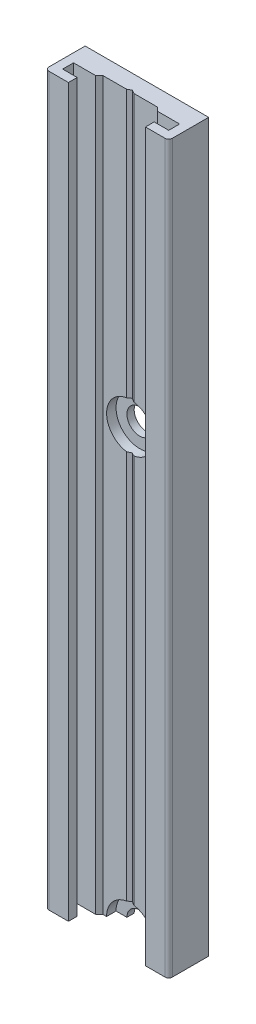
ISO-10303-21;
HEADER;
FILE_DESCRIPTION(('STEP AP214'),'2;1');
FILE_NAME('part.step','',(''),(''),'','','');
FILE_SCHEMA(('AUTOMOTIVE_DESIGN { 1 0 10303 214 1 1 1 1 }'));
ENDSEC;
DATA;
#1=APPLICATION_CONTEXT('core data for automotive mechanical design processes');
#2=APPLICATION_PROTOCOL_DEFINITION('international standard','automotive_design',2000,#1);
#3=PRODUCT_CONTEXT('',#1,'mechanical');
#4=PRODUCT('Part','Part','',(#3));
#5=PRODUCT_RELATED_PRODUCT_CATEGORY('part','',(#4));
#6=PRODUCT_DEFINITION_FORMATION('','',#4);
#7=PRODUCT_DEFINITION_CONTEXT('part definition',#1,'design');
#8=PRODUCT_DEFINITION('design','',#6,#7);
#9=PRODUCT_DEFINITION_SHAPE('','',#8);
#10=(LENGTH_UNIT() NAMED_UNIT(*) SI_UNIT(.MILLI.,.METRE.));
#11=(NAMED_UNIT(*) PLANE_ANGLE_UNIT() SI_UNIT($,.RADIAN.));
#12=(NAMED_UNIT(*) SI_UNIT($,.STERADIAN.) SOLID_ANGLE_UNIT());
#13=UNCERTAINTY_MEASURE_WITH_UNIT(LENGTH_MEASURE(1.E-05),#10,'distance_accuracy_value','');
#14=(GEOMETRIC_REPRESENTATION_CONTEXT(3) GLOBAL_UNCERTAINTY_ASSIGNED_CONTEXT((#13)) GLOBAL_UNIT_ASSIGNED_CONTEXT((#10,
#11,#12)) REPRESENTATION_CONTEXT('',''));
#15=CARTESIAN_POINT('',(0.,0.,0.));
#16=DIRECTION('',(0.,0.,1.));
#17=DIRECTION('',(1.,0.,0.));
#18=AXIS2_PLACEMENT_3D('',#15,#16,#17);
#19=CARTESIAN_POINT('',(0.499999996020775,100.,2.3));
#20=DIRECTION('',(-0.49999999403116,0.,0.86602540723055));
#21=DIRECTION('',(0.86602540723055,0.,0.49999999403116));
#22=AXIS2_PLACEMENT_3D('',#19,#20,#21);
#23=PLANE('',#22);
#24=DIRECTION('',(0.,-1.,0.));
#25=VECTOR('',#24,1.);
#26=CARTESIAN_POINT('',(0.499999996020775,100.,2.3));
#27=LINE('',#26,#25);
#28=CARTESIAN_POINT('',(0.499999996020775,56.7886918547142,2.3));
#29=VERTEX_POINT('',#28);
#30=CARTESIAN_POINT('',(0.499999996020775,3.21130814528585,2.3));
#31=VERTEX_POINT('',#30);
#32=EDGE_CURVE('E242',#29,#31,#27,.T.);
#33=ORIENTED_EDGE('',*,*,#32,.F.);
#34=CARTESIAN_POINT('',(0.,60.,2.01132487229741));
#35=DIRECTION('',(-0.49999999403116,0.,0.86602540723055));
#36=DIRECTION('',(0.86602540723055,0.,0.49999999403116));
#37=AXIS2_PLACEMENT_3D('',#34,#35,#36);
#38=ELLIPSE('',#37,3.75277673479942,3.25);
#39=CARTESIAN_POINT('',(-5.96883935506665E-09,56.75,2.0113248688513));
#40=VERTEX_POINT('',#39);
#41=EDGE_CURVE('E222',#29,#40,#38,.F.);
#42=ORIENTED_EDGE('',*,*,#41,.T.);
#43=DIRECTION('',(0.,1.,0.));
#44=VECTOR('',#43,1.);
#45=CARTESIAN_POINT('',(-5.96883935506665E-09,100.,2.0113248688513));
#46=LINE('',#45,#44);
#47=CARTESIAN_POINT('',(-5.96883935506665E-09,3.25000000000004,2.0113248688513));
#48=VERTEX_POINT('',#47);
#49=EDGE_CURVE('E252',#40,#48,#46,.F.);
#50=ORIENTED_EDGE('',*,*,#49,.T.);
#51=CARTESIAN_POINT('',(0.,0.,2.01132487229741));
#52=DIRECTION('',(-0.49999999403116,0.,0.86602540723055));
#53=DIRECTION('',(0.86602540723055,0.,0.49999999403116));
#54=AXIS2_PLACEMENT_3D('',#51,#52,#53);
#55=ELLIPSE('',#54,3.75277673479942,3.25);
#56=EDGE_CURVE('E387',#48,#31,#55,.F.);
#57=ORIENTED_EDGE('',*,*,#56,.T.);
#58=EDGE_LOOP('',(#33,#42,#50,#57));
#59=FACE_BOUND('',#58,.T.);
#60=ADVANCED_FACE('F33',(#59),#23,.T.);
#61=CARTESIAN_POINT('',(-0.5,100.,2.3));
#62=DIRECTION('',(-0.5,0.,-0.866025403784439));
#63=DIRECTION('',(-0.866025403784439,0.,0.5));
#64=AXIS2_PLACEMENT_3D('',#61,#62,#63);
#65=PLANE('',#64);
#66=DIRECTION('',(0.,-1.,0.));
#67=VECTOR('',#66,1.);
#68=CARTESIAN_POINT('',(-0.5,100.,2.3));
#69=LINE('',#68,#67);
#70=CARTESIAN_POINT('',(-0.5,100.,2.3));
#71=VERTEX_POINT('',#70);
#72=CARTESIAN_POINT('',(-0.5,63.2113081446663,2.3));
#73=VERTEX_POINT('',#72);
#74=EDGE_CURVE('E249',#71,#73,#69,.T.);
#75=ORIENTED_EDGE('',*,*,#74,.T.);
#76=CARTESIAN_POINT('',(0.,60.,2.01132486540519));
#77=DIRECTION('',(-0.5,0.,-0.866025403784439));
#78=DIRECTION('',(-0.866025403784439,0.,0.5));
#79=AXIS2_PLACEMENT_3D('',#76,#77,#78);
#80=ELLIPSE('',#79,3.75277674973257,3.25);
#81=CARTESIAN_POINT('',(-5.96883935506665E-09,63.25,2.0113248688513));
#82=VERTEX_POINT('',#81);
#83=EDGE_CURVE('E48',#73,#82,#80,.T.);
#84=ORIENTED_EDGE('',*,*,#83,.T.);
#85=CARTESIAN_POINT('',(-5.96883935506665E-09,100.,2.0113248688513));
#86=VERTEX_POINT('',#85);
#87=EDGE_CURVE('E234',#86,#82,#46,.F.);
#88=ORIENTED_EDGE('',*,*,#87,.F.);
#89=DIRECTION('',(0.866025403784439,0.,-0.5));
#90=VECTOR('',#89,1.);
#91=CARTESIAN_POINT('',(-0.5,100.,2.3));
#92=LINE('',#91,#90);
#93=EDGE_CURVE('E347',#71,#86,#92,.T.);
#94=ORIENTED_EDGE('',*,*,#93,.F.);
#95=EDGE_LOOP('',(#75,#84,#88,#94));
#96=FACE_BOUND('',#95,.T.);
#97=ADVANCED_FACE('F517',(#96),#65,.F.);
#98=CARTESIAN_POINT('',(-8.,0.,5.));
#99=DIRECTION('',(0.,1.,0.));
#100=DIRECTION('',(0.,0.,1.));
#101=AXIS2_PLACEMENT_3D('',#98,#99,#100);
#102=PLANE('',#101);
#103=DIRECTION('',(-1.,0.,0.));
#104=VECTOR('',#103,1.);
#105=CARTESIAN_POINT('',(-8.,0.,1.));
#106=LINE('',#105,#104);
#107=CARTESIAN_POINT('',(3.25,0.,1.));
#108=VERTEX_POINT('',#107);
#109=CARTESIAN_POINT('',(1.75,0.,1.));
#110=VERTEX_POINT('',#109);
#111=EDGE_CURVE('E354',#108,#110,#106,.T.);
#112=ORIENTED_EDGE('',*,*,#111,.T.);
#113=DIRECTION('',(0.,0.,1.));
#114=VECTOR('',#113,1.);
#115=CARTESIAN_POINT('',(1.75,0.,0.));
#116=LINE('',#115,#114);
#117=CARTESIAN_POINT('',(1.75,0.,0.));
#118=VERTEX_POINT('',#117);
#119=EDGE_CURVE('E41',#110,#118,#116,.F.);
#120=ORIENTED_EDGE('',*,*,#119,.T.);
#121=DIRECTION('',(-1.,0.,0.));
#122=VECTOR('',#121,1.);
#123=CARTESIAN_POINT('',(8.5,0.,0.));
#124=LINE('',#123,#122);
#125=CARTESIAN_POINT('',(8.5,0.,0.));
#126=VERTEX_POINT('',#125);
#127=EDGE_CURVE('E283',#126,#118,#124,.T.);
#128=ORIENTED_EDGE('',*,*,#127,.F.);
#129=DIRECTION('',(0.,0.,-1.));
#130=VECTOR('',#129,1.);
#131=CARTESIAN_POINT('',(8.5,0.,5.));
#132=LINE('',#131,#130);
#133=CARTESIAN_POINT('',(8.5,0.,5.));
#134=VERTEX_POINT('',#133);
#135=EDGE_CURVE('E279',#134,#126,#132,.T.);
#136=ORIENTED_EDGE('',*,*,#135,.F.);
#137=CARTESIAN_POINT('',(8.,0.,5.));
#138=DIRECTION('',(0.,1.,0.));
#139=DIRECTION('',(0.,0.,1.));
#140=AXIS2_PLACEMENT_3D('',#137,#138,#139);
#141=CIRCLE('',#140,0.5);
#142=CARTESIAN_POINT('',(8.,0.,5.5));
#143=VERTEX_POINT('',#142);
#144=EDGE_CURVE('E276',#143,#134,#141,.T.);
#145=ORIENTED_EDGE('',*,*,#144,.F.);
#146=DIRECTION('',(1.,0.,0.));
#147=VECTOR('',#146,1.);
#148=CARTESIAN_POINT('',(-8.,0.,5.5));
#149=LINE('',#148,#147);
#150=CARTESIAN_POINT('',(5.3,0.,5.5));
#151=VERTEX_POINT('',#150);
#152=EDGE_CURVE('E271',#151,#143,#149,.T.);
#153=ORIENTED_EDGE('',*,*,#152,.F.);
#154=DIRECTION('',(0.,0.,1.));
#155=VECTOR('',#154,1.);
#156=CARTESIAN_POINT('',(5.3,0.,4.3));
#157=LINE('',#156,#155);
#158=CARTESIAN_POINT('',(5.3,0.,4.3));
#159=VERTEX_POINT('',#158);
#160=EDGE_CURVE('E392',#159,#151,#157,.T.);
#161=ORIENTED_EDGE('',*,*,#160,.F.);
#162=DIRECTION('',(-1.,0.,0.));
#163=VECTOR('',#162,1.);
#164=CARTESIAN_POINT('',(7.3,0.,4.3));
#165=LINE('',#164,#163);
#166=CARTESIAN_POINT('',(7.3,0.,4.3));
#167=VERTEX_POINT('',#166);
#168=EDGE_CURVE('E397',#167,#159,#165,.T.);
#169=ORIENTED_EDGE('',*,*,#168,.F.);
#170=DIRECTION('',(0.,0.,1.));
#171=VECTOR('',#170,1.);
#172=CARTESIAN_POINT('',(7.3,0.,2.8));
#173=LINE('',#172,#171);
#174=CARTESIAN_POINT('',(7.3,0.,2.8));
#175=VERTEX_POINT('',#174);
#176=EDGE_CURVE('E437',#175,#167,#173,.T.);
#177=ORIENTED_EDGE('',*,*,#176,.F.);
#178=DIRECTION('',(1.,0.,0.));
#179=VECTOR('',#178,1.);
#180=CARTESIAN_POINT('',(3.75,0.,2.8));
#181=LINE('',#180,#179);
#182=CARTESIAN_POINT('',(4.25,0.,2.8));
#183=VERTEX_POINT('',#182);
#184=EDGE_CURVE('E336',#183,#175,#181,.T.);
#185=ORIENTED_EDGE('',*,*,#184,.F.);
#186=DIRECTION('',(-0.707106781186551,0.,-0.707106781186544));
#187=VECTOR('',#186,1.);
#188=CARTESIAN_POINT('',(3.75,0.,2.3));
#189=LINE('',#188,#187);
#190=CARTESIAN_POINT('',(3.75,0.,2.3));
#191=VERTEX_POINT('',#190);
#192=EDGE_CURVE('E333',#191,#183,#189,.F.);
#193=ORIENTED_EDGE('',*,*,#192,.F.);
#194=DIRECTION('',(1.,0.,0.));
#195=VECTOR('',#194,1.);
#196=CARTESIAN_POINT('',(0.499999996020775,0.,2.3));
#197=LINE('',#196,#195);
#198=CARTESIAN_POINT('',(3.25,0.,2.3));
#199=VERTEX_POINT('',#198);
#200=EDGE_CURVE('E337',#199,#191,#197,.T.);
#201=ORIENTED_EDGE('',*,*,#200,.F.);
#202=DIRECTION('',(0.,0.,1.));
#203=VECTOR('',#202,1.);
#204=CARTESIAN_POINT('',(3.25,0.,0.));
#205=LINE('',#204,#203);
#206=EDGE_CURVE('E363',#199,#108,#205,.F.);
#207=ORIENTED_EDGE('',*,*,#206,.T.);
#208=EDGE_LOOP('',(#112,#120,#128,#136,#145,#153,#161,#169,#177,#185,#193,#201,#207));
#209=FACE_BOUND('',#208,.T.);
#210=ADVANCED_FACE('F361',(#209),#102,.F.);
#211=CARTESIAN_POINT('',(-8.,0.,5.5));
#212=DIRECTION('',(0.,0.,1.));
#213=DIRECTION('',(1.,0.,0.));
#214=AXIS2_PLACEMENT_3D('',#211,#212,#213);
#215=PLANE('',#214);
#216=DIRECTION('',(0.,-1.,0.));
#217=VECTOR('',#216,1.);
#218=CARTESIAN_POINT('',(5.3,100.,5.5));
#219=LINE('',#218,#217);
#220=CARTESIAN_POINT('',(5.3,100.,5.5));
#221=VERTEX_POINT('',#220);
#222=EDGE_CURVE('E264',#221,#151,#219,.T.);
#223=ORIENTED_EDGE('',*,*,#222,.T.);
#224=ORIENTED_EDGE('',*,*,#152,.T.);
#225=DIRECTION('',(0.,1.,0.));
#226=VECTOR('',#225,1.);
#227=CARTESIAN_POINT('',(8.,0.,5.5));
#228=LINE('',#227,#226);
#229=CARTESIAN_POINT('',(8.,100.,5.5));
#230=VERTEX_POINT('',#229);
#231=EDGE_CURVE('E318',#143,#230,#228,.T.);
#232=ORIENTED_EDGE('',*,*,#231,.T.);
#233=DIRECTION('',(1.,0.,0.));
#234=VECTOR('',#233,1.);
#235=CARTESIAN_POINT('',(-8.,100.,5.5));
#236=LINE('',#235,#234);
#237=EDGE_CURVE('E293',#221,#230,#236,.T.);
#238=ORIENTED_EDGE('',*,*,#237,.F.);
#239=EDGE_LOOP('',(#223,#224,#232,#238));
#240=FACE_BOUND('',#239,.T.);
#241=ADVANCED_FACE('F503',(#240),#215,.T.);
#242=CARTESIAN_POINT('',(-8.,0.,5.));
#243=DIRECTION('',(0.,1.,0.));
#244=DIRECTION('',(0.,0.,1.));
#245=AXIS2_PLACEMENT_3D('',#242,#243,#244);
#246=CYLINDRICAL_SURFACE('',#245,0.5);
#247=CARTESIAN_POINT('',(-8.,100.,5.));
#248=DIRECTION('',(0.,1.,0.));
#249=DIRECTION('',(0.,0.,1.));
#250=AXIS2_PLACEMENT_3D('',#247,#248,#249);
#251=CIRCLE('',#250,0.5);
#252=CARTESIAN_POINT('',(-8.5,100.,5.));
#253=VERTEX_POINT('',#252);
#254=CARTESIAN_POINT('',(-8.,100.,5.5));
#255=VERTEX_POINT('',#254);
#256=EDGE_CURVE('E290',#253,#255,#251,.T.);
#257=ORIENTED_EDGE('',*,*,#256,.F.);
#258=DIRECTION('',(0.,1.,0.));
#259=VECTOR('',#258,1.);
#260=CARTESIAN_POINT('',(-8.5,0.,5.));
#261=LINE('',#260,#259);
#262=CARTESIAN_POINT('',(-8.5,0.,5.));
#263=VERTEX_POINT('',#262);
#264=EDGE_CURVE('E309',#263,#253,#261,.T.);
#265=ORIENTED_EDGE('',*,*,#264,.F.);
#266=CARTESIAN_POINT('',(-8.,0.,5.));
#267=DIRECTION('',(0.,1.,0.));
#268=DIRECTION('',(0.,0.,1.));
#269=AXIS2_PLACEMENT_3D('',#266,#267,#268);
#270=CIRCLE('',#269,0.5);
#271=CARTESIAN_POINT('',(-8.,0.,5.5));
#272=VERTEX_POINT('',#271);
#273=EDGE_CURVE('E268',#263,#272,#270,.T.);
#274=ORIENTED_EDGE('',*,*,#273,.T.);
#275=DIRECTION('',(0.,1.,0.));
#276=VECTOR('',#275,1.);
#277=CARTESIAN_POINT('',(-8.,0.,5.5));
#278=LINE('',#277,#276);
#279=EDGE_CURVE('E289',#272,#255,#278,.T.);
#280=ORIENTED_EDGE('',*,*,#279,.T.);
#281=EDGE_LOOP('',(#257,#265,#274,#280));
#282=FACE_BOUND('',#281,.T.);
#283=ADVANCED_FACE('F566',(#282),#246,.T.);
#284=CARTESIAN_POINT('',(-8.5,0.,0.));
#285=DIRECTION('',(-1.,0.,0.));
#286=DIRECTION('',(0.,0.,1.));
#287=AXIS2_PLACEMENT_3D('',#284,#285,#286);
#288=PLANE('',#287);
#289=DIRECTION('',(0.,0.,1.));
#290=VECTOR('',#289,1.);
#291=CARTESIAN_POINT('',(-8.5,100.,0.));
#292=LINE('',#291,#290);
#293=CARTESIAN_POINT('',(-8.5,100.,0.));
#294=VERTEX_POINT('',#293);
#295=EDGE_CURVE('E272',#294,#253,#292,.T.);
#296=ORIENTED_EDGE('',*,*,#295,.F.);
#297=DIRECTION('',(0.,1.,0.));
#298=VECTOR('',#297,1.);
#299=CARTESIAN_POINT('',(-8.5,0.,0.));
#300=LINE('',#299,#298);
#301=CARTESIAN_POINT('',(-8.5,0.,0.));
#302=VERTEX_POINT('',#301);
#303=EDGE_CURVE('E312',#302,#294,#300,.T.);
#304=ORIENTED_EDGE('',*,*,#303,.F.);
#305=DIRECTION('',(0.,0.,1.));
#306=VECTOR('',#305,1.);
#307=CARTESIAN_POINT('',(-8.5,0.,0.));
#308=LINE('',#307,#306);
#309=EDGE_CURVE('E286',#302,#263,#308,.T.);
#310=ORIENTED_EDGE('',*,*,#309,.T.);
#311=ORIENTED_EDGE('',*,*,#264,.T.);
#312=EDGE_LOOP('',(#296,#304,#310,#311));
#313=FACE_BOUND('',#312,.T.);
#314=ADVANCED_FACE('F489',(#313),#288,.T.);
#315=CARTESIAN_POINT('',(8.5,0.,0.));
#316=DIRECTION('',(0.,0.,-1.));
#317=DIRECTION('',(-1.,0.,0.));
#318=AXIS2_PLACEMENT_3D('',#315,#316,#317);
#319=PLANE('',#318);
#320=CARTESIAN_POINT('',(0.,60.,0.));
#321=DIRECTION('',(0.,0.,1.));
#322=DIRECTION('',(1.,0.,0.));
#323=AXIS2_PLACEMENT_3D('',#320,#321,#322);
#324=CIRCLE('',#323,1.75000000000001);
#325=CARTESIAN_POINT('',(1.75000000000001,60.,0.));
#326=VERTEX_POINT('',#325);
#327=EDGE_CURVE('E226',#326,#326,#324,.T.);
#328=ORIENTED_EDGE('',*,*,#327,.T.);
#329=EDGE_LOOP('',(#328));
#330=FACE_BOUND('',#329,.T.);
#331=CARTESIAN_POINT('',(0.,0.,0.));
#332=DIRECTION('',(0.,0.,1.));
#333=DIRECTION('',(1.,0.,0.));
#334=AXIS2_PLACEMENT_3D('',#331,#332,#333);
#335=CIRCLE('',#334,1.75);
#336=CARTESIAN_POINT('',(-1.75,0.,0.));
#337=VERTEX_POINT('',#336);
#338=EDGE_CURVE('E379',#118,#337,#335,.T.);
#339=ORIENTED_EDGE('',*,*,#338,.T.);
#340=EDGE_CURVE('E282',#337,#302,#124,.T.);
#341=ORIENTED_EDGE('',*,*,#340,.T.);
#342=ORIENTED_EDGE('',*,*,#303,.T.);
#343=DIRECTION('',(-1.,0.,0.));
#344=VECTOR('',#343,1.);
#345=CARTESIAN_POINT('',(8.5,100.,0.));
#346=LINE('',#345,#344);
#347=CARTESIAN_POINT('',(8.5,100.,0.));
#348=VERTEX_POINT('',#347);
#349=EDGE_CURVE('E304',#348,#294,#346,.T.);
#350=ORIENTED_EDGE('',*,*,#349,.F.);
#351=DIRECTION('',(0.,1.,0.));
#352=VECTOR('',#351,1.);
#353=CARTESIAN_POINT('',(8.5,0.,0.));
#354=LINE('',#353,#352);
#355=EDGE_CURVE('E314',#126,#348,#354,.T.);
#356=ORIENTED_EDGE('',*,*,#355,.F.);
#357=ORIENTED_EDGE('',*,*,#127,.T.);
#358=EDGE_LOOP('',(#339,#341,#342,#350,#356,#357));
#359=FACE_BOUND('',#358,.T.);
#360=ADVANCED_FACE('F482',(#330,#359),#319,.T.);
#361=CARTESIAN_POINT('',(8.5,0.,5.));
#362=DIRECTION('',(1.,0.,0.));
#363=DIRECTION('',(0.,0.,-1.));
#364=AXIS2_PLACEMENT_3D('',#361,#362,#363);
#365=PLANE('',#364);
#366=DIRECTION('',(0.,0.,-1.));
#367=VECTOR('',#366,1.);
#368=CARTESIAN_POINT('',(8.5,100.,5.));
#369=LINE('',#368,#367);
#370=CARTESIAN_POINT('',(8.5,100.,5.));
#371=VERTEX_POINT('',#370);
#372=EDGE_CURVE('E301',#371,#348,#369,.T.);
#373=ORIENTED_EDGE('',*,*,#372,.F.);
#374=DIRECTION('',(0.,1.,0.));
#375=VECTOR('',#374,1.);
#376=CARTESIAN_POINT('',(8.5,0.,5.));
#377=LINE('',#376,#375);
#378=EDGE_CURVE('E316',#134,#371,#377,.T.);
#379=ORIENTED_EDGE('',*,*,#378,.F.);
#380=ORIENTED_EDGE('',*,*,#135,.T.);
#381=ORIENTED_EDGE('',*,*,#355,.T.);
#382=EDGE_LOOP('',(#373,#379,#380,#381));
#383=FACE_BOUND('',#382,.T.);
#384=ADVANCED_FACE('F495',(#383),#365,.T.);
#385=CARTESIAN_POINT('',(8.,0.,5.));
#386=DIRECTION('',(0.,1.,0.));
#387=DIRECTION('',(0.,0.,1.));
#388=AXIS2_PLACEMENT_3D('',#385,#386,#387);
#389=CYLINDRICAL_SURFACE('',#388,0.5);
#390=CARTESIAN_POINT('',(8.,100.,5.));
#391=DIRECTION('',(0.,1.,0.));
#392=DIRECTION('',(0.,0.,1.));
#393=AXIS2_PLACEMENT_3D('',#390,#391,#392);
#394=CIRCLE('',#393,0.5);
#395=EDGE_CURVE('E298',#230,#371,#394,.T.);
#396=ORIENTED_EDGE('',*,*,#395,.F.);
#397=ORIENTED_EDGE('',*,*,#231,.F.);
#398=ORIENTED_EDGE('',*,*,#144,.T.);
#399=ORIENTED_EDGE('',*,*,#378,.T.);
#400=EDGE_LOOP('',(#396,#397,#398,#399));
#401=FACE_BOUND('',#400,.T.);
#402=ADVANCED_FACE('F500',(#401),#389,.T.);
#403=DIRECTION('',(0.,-1.,0.));
#404=VECTOR('',#403,1.);
#405=CARTESIAN_POINT('',(-5.3,100.,5.5));
#406=LINE('',#405,#404);
#407=CARTESIAN_POINT('',(-5.3,100.,5.5));
#408=VERTEX_POINT('',#407);
#409=CARTESIAN_POINT('',(-5.3,0.,5.5));
#410=VERTEX_POINT('',#409);
#411=EDGE_CURVE('E262',#408,#410,#406,.T.);
#412=ORIENTED_EDGE('',*,*,#411,.F.);
#413=EDGE_CURVE('E295',#255,#408,#236,.T.);
#414=ORIENTED_EDGE('',*,*,#413,.F.);
#415=ORIENTED_EDGE('',*,*,#279,.F.);
#416=EDGE_CURVE('E273',#272,#410,#149,.T.);
#417=ORIENTED_EDGE('',*,*,#416,.T.);
#418=EDGE_LOOP('',(#412,#414,#415,#417));
#419=FACE_BOUND('',#418,.T.);
#420=ADVANCED_FACE('F564',(#419),#215,.T.);
#421=ORIENTED_EDGE('',*,*,#340,.F.);
#422=DIRECTION('',(0.,0.,1.));
#423=VECTOR('',#422,1.);
#424=CARTESIAN_POINT('',(-1.75,0.,0.));
#425=LINE('',#424,#423);
#426=CARTESIAN_POINT('',(-1.75,0.,1.));
#427=VERTEX_POINT('',#426);
#428=EDGE_CURVE('E353',#337,#427,#425,.T.);
#429=ORIENTED_EDGE('',*,*,#428,.T.);
#430=CARTESIAN_POINT('',(-3.25,0.,1.));
#431=VERTEX_POINT('',#430);
#432=EDGE_CURVE('E350',#427,#431,#106,.T.);
#433=ORIENTED_EDGE('',*,*,#432,.T.);
#434=DIRECTION('',(0.,0.,1.));
#435=VECTOR('',#434,1.);
#436=CARTESIAN_POINT('',(-3.25,0.,0.));
#437=LINE('',#436,#435);
#438=CARTESIAN_POINT('',(-3.25,0.,2.3));
#439=VERTEX_POINT('',#438);
#440=EDGE_CURVE('E376',#431,#439,#437,.T.);
#441=ORIENTED_EDGE('',*,*,#440,.T.);
#442=DIRECTION('',(1.,0.,0.));
#443=VECTOR('',#442,1.);
#444=CARTESIAN_POINT('',(-3.75,0.,2.3));
#445=LINE('',#444,#443);
#446=CARTESIAN_POINT('',(-3.75,0.,2.3));
#447=VERTEX_POINT('',#446);
#448=EDGE_CURVE('E325',#447,#439,#445,.T.);
#449=ORIENTED_EDGE('',*,*,#448,.F.);
#450=DIRECTION('',(-0.707106781186551,0.,0.707106781186544));
#451=VECTOR('',#450,1.);
#452=CARTESIAN_POINT('',(-3.75,0.,2.3));
#453=LINE('',#452,#451);
#454=CARTESIAN_POINT('',(-4.25,0.,2.8));
#455=VERTEX_POINT('',#454);
#456=EDGE_CURVE('E322',#455,#447,#453,.F.);
#457=ORIENTED_EDGE('',*,*,#456,.F.);
#458=DIRECTION('',(1.,0.,0.));
#459=VECTOR('',#458,1.);
#460=CARTESIAN_POINT('',(-7.3,0.,2.8));
#461=LINE('',#460,#459);
#462=CARTESIAN_POINT('',(-7.3,0.,2.8));
#463=VERTEX_POINT('',#462);
#464=EDGE_CURVE('E326',#463,#455,#461,.T.);
#465=ORIENTED_EDGE('',*,*,#464,.F.);
#466=DIRECTION('',(0.,0.,-1.));
#467=VECTOR('',#466,1.);
#468=CARTESIAN_POINT('',(-7.3,0.,4.3));
#469=LINE('',#468,#467);
#470=CARTESIAN_POINT('',(-7.3,0.,4.3));
#471=VERTEX_POINT('',#470);
#472=EDGE_CURVE('E427',#471,#463,#469,.T.);
#473=ORIENTED_EDGE('',*,*,#472,.F.);
#474=DIRECTION('',(-1.,0.,0.));
#475=VECTOR('',#474,1.);
#476=CARTESIAN_POINT('',(-5.3,0.,4.3));
#477=LINE('',#476,#475);
#478=CARTESIAN_POINT('',(-5.3,0.,4.3));
#479=VERTEX_POINT('',#478);
#480=EDGE_CURVE('E424',#479,#471,#477,.T.);
#481=ORIENTED_EDGE('',*,*,#480,.F.);
#482=DIRECTION('',(0.,0.,-1.));
#483=VECTOR('',#482,1.);
#484=CARTESIAN_POINT('',(-5.3,0.,5.5));
#485=LINE('',#484,#483);
#486=EDGE_CURVE('E421',#410,#479,#485,.T.);
#487=ORIENTED_EDGE('',*,*,#486,.F.);
#488=ORIENTED_EDGE('',*,*,#416,.F.);
#489=ORIENTED_EDGE('',*,*,#273,.F.);
#490=ORIENTED_EDGE('',*,*,#309,.F.);
#491=EDGE_LOOP('',(#421,#429,#433,#441,#449,#457,#465,#473,#481,#487,#488,#489,#490));
#492=FACE_BOUND('',#491,.T.);
#493=ADVANCED_FACE('F477',(#492),#102,.F.);
#494=CARTESIAN_POINT('',(-8.,100.,5.));
#495=DIRECTION('',(0.,1.,0.));
#496=DIRECTION('',(0.,0.,1.));
#497=AXIS2_PLACEMENT_3D('',#494,#495,#496);
#498=PLANE('',#497);
#499=DIRECTION('',(0.,0.,1.));
#500=VECTOR('',#499,1.);
#501=CARTESIAN_POINT('',(5.3,100.,4.3));
#502=LINE('',#501,#500);
#503=CARTESIAN_POINT('',(5.3,100.,4.3));
#504=VERTEX_POINT('',#503);
#505=EDGE_CURVE('E393',#504,#221,#502,.T.);
#506=ORIENTED_EDGE('',*,*,#505,.T.);
#507=ORIENTED_EDGE('',*,*,#237,.T.);
#508=ORIENTED_EDGE('',*,*,#395,.T.);
#509=ORIENTED_EDGE('',*,*,#372,.T.);
#510=ORIENTED_EDGE('',*,*,#349,.T.);
#511=ORIENTED_EDGE('',*,*,#295,.T.);
#512=ORIENTED_EDGE('',*,*,#256,.T.);
#513=ORIENTED_EDGE('',*,*,#413,.T.);
#514=DIRECTION('',(0.,0.,-1.));
#515=VECTOR('',#514,1.);
#516=CARTESIAN_POINT('',(-5.3,100.,5.5));
#517=LINE('',#516,#515);
#518=CARTESIAN_POINT('',(-5.3,100.,4.3));
#519=VERTEX_POINT('',#518);
#520=EDGE_CURVE('E396',#408,#519,#517,.T.);
#521=ORIENTED_EDGE('',*,*,#520,.T.);
#522=DIRECTION('',(-1.,0.,0.));
#523=VECTOR('',#522,1.);
#524=CARTESIAN_POINT('',(-5.3,100.,4.3));
#525=LINE('',#524,#523);
#526=CARTESIAN_POINT('',(-7.3,100.,4.3));
#527=VERTEX_POINT('',#526);
#528=EDGE_CURVE('E400',#519,#527,#525,.T.);
#529=ORIENTED_EDGE('',*,*,#528,.T.);
#530=DIRECTION('',(0.,0.,-1.));
#531=VECTOR('',#530,1.);
#532=CARTESIAN_POINT('',(-7.3,100.,4.3));
#533=LINE('',#532,#531);
#534=CARTESIAN_POINT('',(-7.3,100.,2.8));
#535=VERTEX_POINT('',#534);
#536=EDGE_CURVE('E403',#527,#535,#533,.T.);
#537=ORIENTED_EDGE('',*,*,#536,.T.);
#538=DIRECTION('',(1.,0.,0.));
#539=VECTOR('',#538,1.);
#540=CARTESIAN_POINT('',(-7.3,100.,2.8));
#541=LINE('',#540,#539);
#542=CARTESIAN_POINT('',(-4.25,100.,2.8));
#543=VERTEX_POINT('',#542);
#544=EDGE_CURVE('E332',#535,#543,#541,.T.);
#545=ORIENTED_EDGE('',*,*,#544,.T.);
#546=DIRECTION('',(-0.707106781186551,0.,0.707106781186544));
#547=VECTOR('',#546,1.);
#548=CARTESIAN_POINT('',(-3.75,100.,2.3));
#549=LINE('',#548,#547);
#550=CARTESIAN_POINT('',(-3.75,100.,2.3));
#551=VERTEX_POINT('',#550);
#552=EDGE_CURVE('E328',#543,#551,#549,.F.);
#553=ORIENTED_EDGE('',*,*,#552,.T.);
#554=DIRECTION('',(1.,0.,0.));
#555=VECTOR('',#554,1.);
#556=CARTESIAN_POINT('',(-3.75,100.,2.3));
#557=LINE('',#556,#555);
#558=EDGE_CURVE('E331',#551,#71,#557,.T.);
#559=ORIENTED_EDGE('',*,*,#558,.T.);
#560=ORIENTED_EDGE('',*,*,#93,.T.);
#561=DIRECTION('',(-0.86602540723055,0.,-0.49999999403116));
#562=VECTOR('',#561,1.);
#563=CARTESIAN_POINT('',(0.499999996020775,100.,2.3));
#564=LINE('',#563,#562);
#565=CARTESIAN_POINT('',(0.499999996020775,100.,2.3));
#566=VERTEX_POINT('',#565);
#567=EDGE_CURVE('E345',#86,#566,#564,.F.);
#568=ORIENTED_EDGE('',*,*,#567,.T.);
#569=DIRECTION('',(1.,0.,0.));
#570=VECTOR('',#569,1.);
#571=CARTESIAN_POINT('',(0.499999996020775,100.,2.3));
#572=LINE('',#571,#570);
#573=CARTESIAN_POINT('',(3.75,100.,2.3));
#574=VERTEX_POINT('',#573);
#575=EDGE_CURVE('E239',#566,#574,#572,.T.);
#576=ORIENTED_EDGE('',*,*,#575,.T.);
#577=DIRECTION('',(-0.707106781186551,0.,-0.707106781186544));
#578=VECTOR('',#577,1.);
#579=CARTESIAN_POINT('',(3.75,100.,2.3));
#580=LINE('',#579,#578);
#581=CARTESIAN_POINT('',(4.25,100.,2.8));
#582=VERTEX_POINT('',#581);
#583=EDGE_CURVE('E338',#574,#582,#580,.F.);
#584=ORIENTED_EDGE('',*,*,#583,.T.);
#585=DIRECTION('',(1.,0.,0.));
#586=VECTOR('',#585,1.);
#587=CARTESIAN_POINT('',(3.75,100.,2.8));
#588=LINE('',#587,#586);
#589=CARTESIAN_POINT('',(7.3,100.,2.8));
#590=VERTEX_POINT('',#589);
#591=EDGE_CURVE('E341',#582,#590,#588,.T.);
#592=ORIENTED_EDGE('',*,*,#591,.T.);
#593=DIRECTION('',(0.,0.,1.));
#594=VECTOR('',#593,1.);
#595=CARTESIAN_POINT('',(7.3,100.,2.8));
#596=LINE('',#595,#594);
#597=CARTESIAN_POINT('',(7.3,100.,4.3));
#598=VERTEX_POINT('',#597);
#599=EDGE_CURVE('E415',#590,#598,#596,.T.);
#600=ORIENTED_EDGE('',*,*,#599,.T.);
#601=DIRECTION('',(-1.,0.,0.));
#602=VECTOR('',#601,1.);
#603=CARTESIAN_POINT('',(7.3,100.,4.3));
#604=LINE('',#603,#602);
#605=EDGE_CURVE('E267',#598,#504,#604,.T.);
#606=ORIENTED_EDGE('',*,*,#605,.T.);
#607=EDGE_LOOP('',(#506,#507,#508,#509,#510,#511,#512,#513,#521,#529,#537,#545,#553,#559,#560,
#568,#576,#584,#592,#600,#606));
#608=FACE_BOUND('',#607,.T.);
#609=ADVANCED_FACE('F461',(#608),#498,.T.);
#610=CARTESIAN_POINT('',(5.3,100.,4.3));
#611=DIRECTION('',(1.,0.,0.));
#612=DIRECTION('',(0.,0.,-1.));
#613=AXIS2_PLACEMENT_3D('',#610,#611,#612);
#614=PLANE('',#613);
#615=ORIENTED_EDGE('',*,*,#160,.T.);
#616=ORIENTED_EDGE('',*,*,#222,.F.);
#617=ORIENTED_EDGE('',*,*,#505,.F.);
#618=DIRECTION('',(0.,-1.,0.));
#619=VECTOR('',#618,1.);
#620=CARTESIAN_POINT('',(5.3,100.,4.3));
#621=LINE('',#620,#619);
#622=EDGE_CURVE('E294',#504,#159,#621,.T.);
#623=ORIENTED_EDGE('',*,*,#622,.T.);
#624=EDGE_LOOP('',(#615,#616,#617,#623));
#625=FACE_BOUND('',#624,.T.);
#626=ADVANCED_FACE('F505',(#625),#614,.F.);
#627=CARTESIAN_POINT('',(7.3,100.,4.3));
#628=DIRECTION('',(0.,0.,1.));
#629=DIRECTION('',(1.,0.,0.));
#630=AXIS2_PLACEMENT_3D('',#627,#628,#629);
#631=PLANE('',#630);
#632=ORIENTED_EDGE('',*,*,#168,.T.);
#633=ORIENTED_EDGE('',*,*,#622,.F.);
#634=ORIENTED_EDGE('',*,*,#605,.F.);
#635=DIRECTION('',(0.,-1.,0.));
#636=VECTOR('',#635,1.);
#637=CARTESIAN_POINT('',(7.3,100.,4.3));
#638=LINE('',#637,#636);
#639=EDGE_CURVE('E443',#598,#167,#638,.T.);
#640=ORIENTED_EDGE('',*,*,#639,.T.);
#641=EDGE_LOOP('',(#632,#633,#634,#640));
#642=FACE_BOUND('',#641,.T.);
#643=ADVANCED_FACE('F457',(#642),#631,.F.);
#644=CARTESIAN_POINT('',(7.3,100.,2.8));
#645=DIRECTION('',(1.,0.,0.));
#646=DIRECTION('',(0.,0.,-1.));
#647=AXIS2_PLACEMENT_3D('',#644,#645,#646);
#648=PLANE('',#647);
#649=ORIENTED_EDGE('',*,*,#176,.T.);
#650=ORIENTED_EDGE('',*,*,#639,.F.);
#651=ORIENTED_EDGE('',*,*,#599,.F.);
#652=DIRECTION('',(0.,-1.,0.));
#653=VECTOR('',#652,1.);
#654=CARTESIAN_POINT('',(7.3,100.,2.8));
#655=LINE('',#654,#653);
#656=EDGE_CURVE('E343',#590,#175,#655,.T.);
#657=ORIENTED_EDGE('',*,*,#656,.T.);
#658=EDGE_LOOP('',(#649,#650,#651,#657));
#659=FACE_BOUND('',#658,.T.);
#660=ADVANCED_FACE('F446',(#659),#648,.F.);
#661=CARTESIAN_POINT('',(3.75,100.,2.8));
#662=DIRECTION('',(0.,0.,-1.));
#663=DIRECTION('',(-1.,0.,0.));
#664=AXIS2_PLACEMENT_3D('',#661,#662,#663);
#665=PLANE('',#664);
#666=ORIENTED_EDGE('',*,*,#184,.T.);
#667=ORIENTED_EDGE('',*,*,#656,.F.);
#668=ORIENTED_EDGE('',*,*,#591,.F.);
#669=DIRECTION('',(0.,1.,0.));
#670=VECTOR('',#669,1.);
#671=CARTESIAN_POINT('',(4.25,100.,2.8));
#672=LINE('',#671,#670);
#673=EDGE_CURVE('E245',#582,#183,#672,.F.);
#674=ORIENTED_EDGE('',*,*,#673,.T.);
#675=EDGE_LOOP('',(#666,#667,#668,#674));
#676=FACE_BOUND('',#675,.T.);
#677=ADVANCED_FACE('F452',(#676),#665,.F.);
#678=CARTESIAN_POINT('',(3.75,100.,2.3));
#679=DIRECTION('',(-0.707106781186544,0.,0.707106781186551));
#680=DIRECTION('',(0.707106781186551,0.,0.707106781186544));
#681=AXIS2_PLACEMENT_3D('',#678,#679,#680);
#682=PLANE('',#681);
#683=ORIENTED_EDGE('',*,*,#192,.T.);
#684=ORIENTED_EDGE('',*,*,#673,.F.);
#685=ORIENTED_EDGE('',*,*,#583,.F.);
#686=DIRECTION('',(0.,-1.,0.));
#687=VECTOR('',#686,1.);
#688=CARTESIAN_POINT('',(3.75,100.,2.3));
#689=LINE('',#688,#687);
#690=EDGE_CURVE('E241',#574,#191,#689,.T.);
#691=ORIENTED_EDGE('',*,*,#690,.T.);
#692=EDGE_LOOP('',(#683,#684,#685,#691));
#693=FACE_BOUND('',#692,.T.);
#694=ADVANCED_FACE('F464',(#693),#682,.T.);
#695=CARTESIAN_POINT('',(0.499999996020775,100.,2.3));
#696=DIRECTION('',(0.,0.,-1.));
#697=DIRECTION('',(-1.,0.,0.));
#698=AXIS2_PLACEMENT_3D('',#695,#696,#697);
#699=PLANE('',#698);
#700=CARTESIAN_POINT('',(0.499999996020775,63.2113081452858,2.3));
#701=VERTEX_POINT('',#700);
#702=EDGE_CURVE('E232',#566,#701,#27,.T.);
#703=ORIENTED_EDGE('',*,*,#702,.T.);
#704=CARTESIAN_POINT('',(0.,60.,2.3));
#705=DIRECTION('',(0.,0.,1.));
#706=DIRECTION('',(1.,0.,0.));
#707=AXIS2_PLACEMENT_3D('',#704,#705,#706);
#708=CIRCLE('',#707,3.25);
#709=EDGE_CURVE('E217',#29,#701,#708,.T.);
#710=ORIENTED_EDGE('',*,*,#709,.F.);
#711=ORIENTED_EDGE('',*,*,#32,.T.);
#712=CARTESIAN_POINT('',(0.,0.,2.3));
#713=DIRECTION('',(0.,0.,1.));
#714=DIRECTION('',(1.,0.,0.));
#715=AXIS2_PLACEMENT_3D('',#712,#713,#714);
#716=CIRCLE('',#715,3.25);
#717=EDGE_CURVE('E377',#199,#31,#716,.T.);
#718=ORIENTED_EDGE('',*,*,#717,.F.);
#719=ORIENTED_EDGE('',*,*,#200,.T.);
#720=ORIENTED_EDGE('',*,*,#690,.F.);
#721=ORIENTED_EDGE('',*,*,#575,.F.);
#722=EDGE_LOOP('',(#703,#710,#711,#718,#719,#720,#721));
#723=FACE_BOUND('',#722,.T.);
#724=ADVANCED_FACE('F237',(#723),#699,.F.);
#725=ORIENTED_EDGE('',*,*,#87,.T.);
#726=EDGE_CURVE('E220',#82,#701,#38,.F.);
#727=ORIENTED_EDGE('',*,*,#726,.T.);
#728=ORIENTED_EDGE('',*,*,#702,.F.);
#729=ORIENTED_EDGE('',*,*,#567,.F.);
#730=EDGE_LOOP('',(#725,#727,#728,#729));
#731=FACE_BOUND('',#730,.T.);
#732=ADVANCED_FACE('F35',(#731),#23,.T.);
#733=ORIENTED_EDGE('',*,*,#49,.F.);
#734=CARTESIAN_POINT('',(-0.5,56.7886918553337,2.3));
#735=VERTEX_POINT('',#734);
#736=EDGE_CURVE('E469',#40,#735,#80,.T.);
#737=ORIENTED_EDGE('',*,*,#736,.T.);
#738=CARTESIAN_POINT('',(-0.5,3.21130814466628,2.3));
#739=VERTEX_POINT('',#738);
#740=EDGE_CURVE('E55',#735,#739,#69,.T.);
#741=ORIENTED_EDGE('',*,*,#740,.T.);
#742=CARTESIAN_POINT('',(0.,0.,2.01132486540519));
#743=DIRECTION('',(-0.5,0.,-0.866025403784439));
#744=DIRECTION('',(-0.866025403784439,0.,0.5));
#745=AXIS2_PLACEMENT_3D('',#742,#743,#744);
#746=ELLIPSE('',#745,3.75277674973257,3.25);
#747=EDGE_CURVE('E385',#739,#48,#746,.T.);
#748=ORIENTED_EDGE('',*,*,#747,.T.);
#749=EDGE_LOOP('',(#733,#737,#741,#748));
#750=FACE_BOUND('',#749,.T.);
#751=ADVANCED_FACE('F468',(#750),#65,.F.);
#752=CARTESIAN_POINT('',(-3.75,100.,2.3));
#753=DIRECTION('',(0.,0.,-1.));
#754=DIRECTION('',(-1.,0.,0.));
#755=AXIS2_PLACEMENT_3D('',#752,#753,#754);
#756=PLANE('',#755);
#757=ORIENTED_EDGE('',*,*,#740,.F.);
#758=CARTESIAN_POINT('',(0.,60.,2.3));
#759=DIRECTION('',(0.,0.,-1.));
#760=DIRECTION('',(-1.,0.,0.));
#761=AXIS2_PLACEMENT_3D('',#758,#759,#760);
#762=CIRCLE('',#761,3.25);
#763=EDGE_CURVE('E11',#735,#73,#762,.T.);
#764=ORIENTED_EDGE('',*,*,#763,.T.);
#765=ORIENTED_EDGE('',*,*,#74,.F.);
#766=ORIENTED_EDGE('',*,*,#558,.F.);
#767=DIRECTION('',(0.,-1.,0.));
#768=VECTOR('',#767,1.);
#769=CARTESIAN_POINT('',(-3.75,100.,2.3));
#770=LINE('',#769,#768);
#771=EDGE_CURVE('E253',#551,#447,#770,.T.);
#772=ORIENTED_EDGE('',*,*,#771,.T.);
#773=ORIENTED_EDGE('',*,*,#448,.T.);
#774=CARTESIAN_POINT('',(0.,0.,2.3));
#775=DIRECTION('',(0.,0.,-1.));
#776=DIRECTION('',(-1.,0.,0.));
#777=AXIS2_PLACEMENT_3D('',#774,#775,#776);
#778=CIRCLE('',#777,3.25);
#779=EDGE_CURVE('E311',#439,#739,#778,.T.);
#780=ORIENTED_EDGE('',*,*,#779,.T.);
#781=EDGE_LOOP('',(#757,#764,#765,#766,#772,#773,#780));
#782=FACE_BOUND('',#781,.T.);
#783=ADVANCED_FACE('F471',(#782),#756,.F.);
#784=CARTESIAN_POINT('',(-3.75,100.,2.3));
#785=DIRECTION('',(0.707106781186544,0.,0.707106781186551));
#786=DIRECTION('',(0.707106781186551,0.,-0.707106781186544));
#787=AXIS2_PLACEMENT_3D('',#784,#785,#786);
#788=PLANE('',#787);
#789=ORIENTED_EDGE('',*,*,#456,.T.);
#790=ORIENTED_EDGE('',*,*,#771,.F.);
#791=ORIENTED_EDGE('',*,*,#552,.F.);
#792=DIRECTION('',(0.,1.,0.));
#793=VECTOR('',#792,1.);
#794=CARTESIAN_POINT('',(-4.25,100.,2.8));
#795=LINE('',#794,#793);
#796=EDGE_CURVE('E255',#543,#455,#795,.F.);
#797=ORIENTED_EDGE('',*,*,#796,.T.);
#798=EDGE_LOOP('',(#789,#790,#791,#797));
#799=FACE_BOUND('',#798,.T.);
#800=ADVANCED_FACE('F537',(#799),#788,.T.);
#801=CARTESIAN_POINT('',(-7.3,100.,2.8));
#802=DIRECTION('',(0.,0.,-1.));
#803=DIRECTION('',(-1.,0.,0.));
#804=AXIS2_PLACEMENT_3D('',#801,#802,#803);
#805=PLANE('',#804);
#806=ORIENTED_EDGE('',*,*,#464,.T.);
#807=ORIENTED_EDGE('',*,*,#796,.F.);
#808=ORIENTED_EDGE('',*,*,#544,.F.);
#809=DIRECTION('',(0.,-1.,0.));
#810=VECTOR('',#809,1.);
#811=CARTESIAN_POINT('',(-7.3,100.,2.8));
#812=LINE('',#811,#810);
#813=EDGE_CURVE('E256',#535,#463,#812,.T.);
#814=ORIENTED_EDGE('',*,*,#813,.T.);
#815=EDGE_LOOP('',(#806,#807,#808,#814));
#816=FACE_BOUND('',#815,.T.);
#817=ADVANCED_FACE('F538',(#816),#805,.F.);
#818=CARTESIAN_POINT('',(-7.3,100.,4.3));
#819=DIRECTION('',(-1.,0.,0.));
#820=DIRECTION('',(0.,0.,1.));
#821=AXIS2_PLACEMENT_3D('',#818,#819,#820);
#822=PLANE('',#821);
#823=ORIENTED_EDGE('',*,*,#472,.T.);
#824=ORIENTED_EDGE('',*,*,#813,.F.);
#825=ORIENTED_EDGE('',*,*,#536,.F.);
#826=DIRECTION('',(0.,-1.,0.));
#827=VECTOR('',#826,1.);
#828=CARTESIAN_POINT('',(-7.3,100.,4.3));
#829=LINE('',#828,#827);
#830=EDGE_CURVE('E258',#527,#471,#829,.T.);
#831=ORIENTED_EDGE('',*,*,#830,.T.);
#832=EDGE_LOOP('',(#823,#824,#825,#831));
#833=FACE_BOUND('',#832,.T.);
#834=ADVANCED_FACE('F541',(#833),#822,.F.);
#835=CARTESIAN_POINT('',(-5.3,100.,4.3));
#836=DIRECTION('',(0.,0.,1.));
#837=DIRECTION('',(1.,0.,0.));
#838=AXIS2_PLACEMENT_3D('',#835,#836,#837);
#839=PLANE('',#838);
#840=ORIENTED_EDGE('',*,*,#480,.T.);
#841=ORIENTED_EDGE('',*,*,#830,.F.);
#842=ORIENTED_EDGE('',*,*,#528,.F.);
#843=DIRECTION('',(0.,-1.,0.));
#844=VECTOR('',#843,1.);
#845=CARTESIAN_POINT('',(-5.3,100.,4.3));
#846=LINE('',#845,#844);
#847=EDGE_CURVE('E260',#519,#479,#846,.T.);
#848=ORIENTED_EDGE('',*,*,#847,.T.);
#849=EDGE_LOOP('',(#840,#841,#842,#848));
#850=FACE_BOUND('',#849,.T.);
#851=ADVANCED_FACE('F545',(#850),#839,.F.);
#852=CARTESIAN_POINT('',(-5.3,100.,5.5));
#853=DIRECTION('',(-1.,0.,0.));
#854=DIRECTION('',(0.,0.,1.));
#855=AXIS2_PLACEMENT_3D('',#852,#853,#854);
#856=PLANE('',#855);
#857=ORIENTED_EDGE('',*,*,#486,.T.);
#858=ORIENTED_EDGE('',*,*,#847,.F.);
#859=ORIENTED_EDGE('',*,*,#520,.F.);
#860=ORIENTED_EDGE('',*,*,#411,.T.);
#861=EDGE_LOOP('',(#857,#858,#859,#860));
#862=FACE_BOUND('',#861,.T.);
#863=ADVANCED_FACE('F548',(#862),#856,.F.);
#864=CARTESIAN_POINT('',(0.,0.,0.));
#865=DIRECTION('',(0.,0.,1.));
#866=DIRECTION('',(1.,0.,0.));
#867=AXIS2_PLACEMENT_3D('',#864,#865,#866);
#868=CYLINDRICAL_SURFACE('',#867,1.75);
#869=ORIENTED_EDGE('',*,*,#338,.F.);
#870=ORIENTED_EDGE('',*,*,#119,.F.);
#871=CARTESIAN_POINT('',(0.,0.,1.));
#872=DIRECTION('',(0.,0.,1.));
#873=DIRECTION('',(1.,0.,0.));
#874=AXIS2_PLACEMENT_3D('',#871,#872,#873);
#875=CIRCLE('',#874,1.75);
#876=EDGE_CURVE('E235',#110,#427,#875,.T.);
#877=ORIENTED_EDGE('',*,*,#876,.T.);
#878=ORIENTED_EDGE('',*,*,#428,.F.);
#879=EDGE_LOOP('',(#869,#870,#877,#878));
#880=FACE_BOUND('',#879,.T.);
#881=ADVANCED_FACE('F480',(#880),#868,.F.);
#882=CARTESIAN_POINT('',(3.25,0.,1.));
#883=DIRECTION('',(0.,0.,-1.));
#884=DIRECTION('',(-1.,0.,0.));
#885=AXIS2_PLACEMENT_3D('',#882,#883,#884);
#886=PLANE('',#885);
#887=CARTESIAN_POINT('',(0.,0.,1.));
#888=DIRECTION('',(0.,0.,1.));
#889=DIRECTION('',(1.,0.,0.));
#890=AXIS2_PLACEMENT_3D('',#887,#888,#889);
#891=CIRCLE('',#890,3.25);
#892=EDGE_CURVE('E369',#108,#431,#891,.T.);
#893=ORIENTED_EDGE('',*,*,#892,.T.);
#894=ORIENTED_EDGE('',*,*,#432,.F.);
#895=ORIENTED_EDGE('',*,*,#876,.F.);
#896=ORIENTED_EDGE('',*,*,#111,.F.);
#897=EDGE_LOOP('',(#893,#894,#895,#896));
#898=FACE_BOUND('',#897,.T.);
#899=ADVANCED_FACE('F368',(#898),#886,.F.);
#900=CARTESIAN_POINT('',(0.,0.,0.));
#901=DIRECTION('',(0.,0.,1.));
#902=DIRECTION('',(1.,0.,0.));
#903=AXIS2_PLACEMENT_3D('',#900,#901,#902);
#904=CYLINDRICAL_SURFACE('',#903,3.25);
#905=ORIENTED_EDGE('',*,*,#892,.F.);
#906=ORIENTED_EDGE('',*,*,#206,.F.);
#907=ORIENTED_EDGE('',*,*,#717,.T.);
#908=ORIENTED_EDGE('',*,*,#56,.F.);
#909=ORIENTED_EDGE('',*,*,#747,.F.);
#910=ORIENTED_EDGE('',*,*,#779,.F.);
#911=ORIENTED_EDGE('',*,*,#440,.F.);
#912=EDGE_LOOP('',(#905,#906,#907,#908,#909,#910,#911));
#913=FACE_BOUND('',#912,.T.);
#914=ADVANCED_FACE('F372',(#913),#904,.F.);
#915=CARTESIAN_POINT('',(0.,60.,0.));
#916=DIRECTION('',(0.,0.,1.));
#917=DIRECTION('',(1.,0.,0.));
#918=AXIS2_PLACEMENT_3D('',#915,#916,#917);
#919=CYLINDRICAL_SURFACE('',#918,3.25);
#920=CARTESIAN_POINT('',(0.,60.,1.));
#921=DIRECTION('',(0.,0.,1.));
#922=DIRECTION('',(1.,0.,0.));
#923=AXIS2_PLACEMENT_3D('',#920,#921,#922);
#924=CIRCLE('',#923,3.25);
#925=CARTESIAN_POINT('',(3.25,60.,1.));
#926=VERTEX_POINT('',#925);
#927=EDGE_CURVE('E227',#926,#926,#924,.T.);
#928=ORIENTED_EDGE('',*,*,#927,.F.);
#929=EDGE_LOOP('',(#928));
#930=FACE_BOUND('',#929,.T.);
#931=ORIENTED_EDGE('',*,*,#83,.F.);
#932=ORIENTED_EDGE('',*,*,#763,.F.);
#933=ORIENTED_EDGE('',*,*,#736,.F.);
#934=ORIENTED_EDGE('',*,*,#41,.F.);
#935=ORIENTED_EDGE('',*,*,#709,.T.);
#936=ORIENTED_EDGE('',*,*,#726,.F.);
#937=EDGE_LOOP('',(#931,#932,#933,#934,#935,#936));
#938=FACE_BOUND('',#937,.T.);
#939=ADVANCED_FACE('F219',(#930,#938),#919,.F.);
#940=CARTESIAN_POINT('',(0.,60.,0.));
#941=DIRECTION('',(0.,0.,1.));
#942=DIRECTION('',(1.,0.,0.));
#943=AXIS2_PLACEMENT_3D('',#940,#941,#942);
#944=CYLINDRICAL_SURFACE('',#943,1.75000000000001);
#945=ORIENTED_EDGE('',*,*,#327,.F.);
#946=EDGE_LOOP('',(#945));
#947=FACE_BOUND('',#946,.T.);
#948=CARTESIAN_POINT('',(0.,60.,1.));
#949=DIRECTION('',(0.,0.,1.));
#950=DIRECTION('',(1.,0.,0.));
#951=AXIS2_PLACEMENT_3D('',#948,#949,#950);
#952=CIRCLE('',#951,1.75000000000001);
#953=CARTESIAN_POINT('',(1.75000000000001,60.,1.));
#954=VERTEX_POINT('',#953);
#955=EDGE_CURVE('E592',#954,#954,#952,.T.);
#956=ORIENTED_EDGE('',*,*,#955,.T.);
#957=EDGE_LOOP('',(#956));
#958=FACE_BOUND('',#957,.T.);
#959=ADVANCED_FACE('F596',(#947,#958),#944,.F.);
#960=CARTESIAN_POINT('',(3.25,60.,1.));
#961=DIRECTION('',(0.,0.,-1.));
#962=DIRECTION('',(-1.,0.,0.));
#963=AXIS2_PLACEMENT_3D('',#960,#961,#962);
#964=PLANE('',#963);
#965=ORIENTED_EDGE('',*,*,#955,.F.);
#966=EDGE_LOOP('',(#965));
#967=FACE_BOUND('',#966,.T.);
#968=ORIENTED_EDGE('',*,*,#927,.T.);
#969=EDGE_LOOP('',(#968));
#970=FACE_BOUND('',#969,.T.);
#971=ADVANCED_FACE('F598',(#967,#970),#964,.F.);
#972=CLOSED_SHELL('',(#60,#97,#210,#241,#283,#314,#360,#384,#402,#420,#493,#609,#626,#643,#660,
#677,#694,#724,#732,#751,#783,#800,#817,#834,#851,#863,#881,#899,#914,#939,#959,#971));
#973=MANIFOLD_SOLID_BREP('B2',#972);
#974=ADVANCED_BREP_SHAPE_REPRESENTATION('',(#18,#973),#14);
#975=SHAPE_DEFINITION_REPRESENTATION(#9,#974);
ENDSEC;
END-ISO-10303-21;
